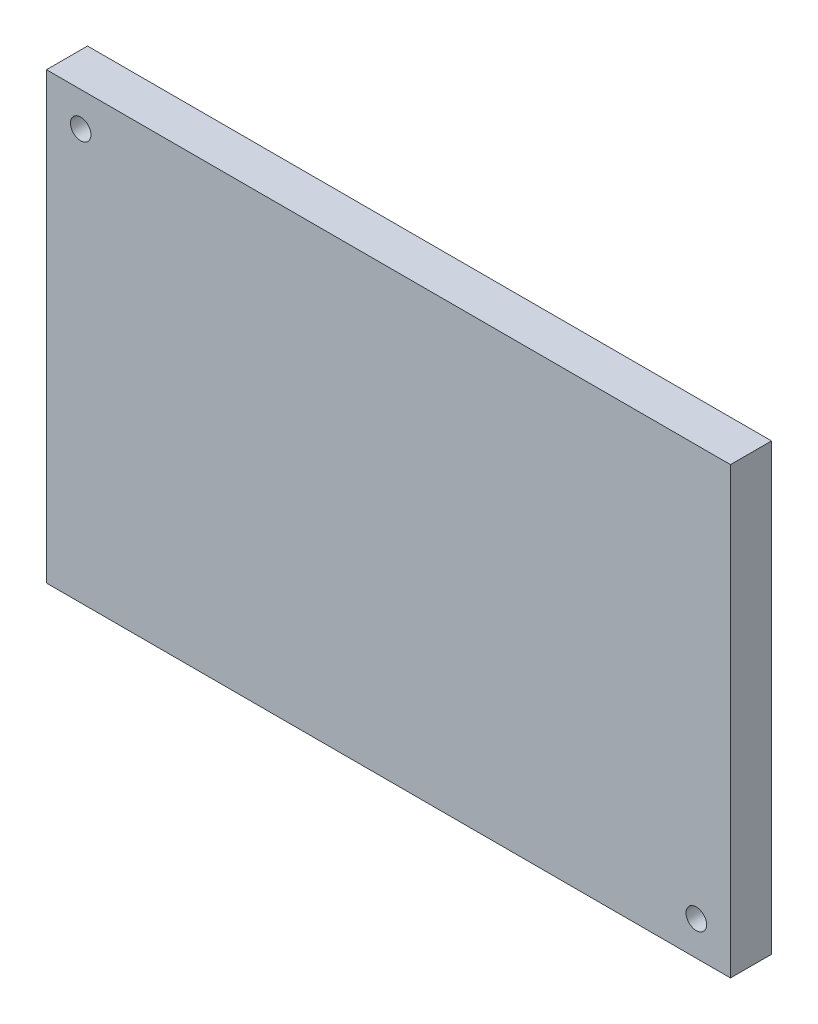
ISO-10303-21;
HEADER;
FILE_DESCRIPTION(('STEP AP214'),'2;1');
FILE_NAME('part.step','',(''),(''),'','','');
FILE_SCHEMA(('AUTOMOTIVE_DESIGN { 1 0 10303 214 1 1 1 1 }'));
ENDSEC;
DATA;
#1=APPLICATION_CONTEXT('core data for automotive mechanical design processes');
#2=APPLICATION_PROTOCOL_DEFINITION('international standard','automotive_design',2000,#1);
#3=PRODUCT_CONTEXT('',#1,'mechanical');
#4=PRODUCT('Part','Part','',(#3));
#5=PRODUCT_RELATED_PRODUCT_CATEGORY('part','',(#4));
#6=PRODUCT_DEFINITION_FORMATION('','',#4);
#7=PRODUCT_DEFINITION_CONTEXT('part definition',#1,'design');
#8=PRODUCT_DEFINITION('design','',#6,#7);
#9=PRODUCT_DEFINITION_SHAPE('','',#8);
#10=(LENGTH_UNIT() NAMED_UNIT(*) SI_UNIT(.MILLI.,.METRE.));
#11=(NAMED_UNIT(*) PLANE_ANGLE_UNIT() SI_UNIT($,.RADIAN.));
#12=(NAMED_UNIT(*) SI_UNIT($,.STERADIAN.) SOLID_ANGLE_UNIT());
#13=UNCERTAINTY_MEASURE_WITH_UNIT(LENGTH_MEASURE(1.E-05),#10,'distance_accuracy_value','');
#14=(GEOMETRIC_REPRESENTATION_CONTEXT(3) GLOBAL_UNCERTAINTY_ASSIGNED_CONTEXT((#13)) GLOBAL_UNIT_ASSIGNED_CONTEXT((#10,
#11,#12)) REPRESENTATION_CONTEXT('',''));
#15=CARTESIAN_POINT('',(0.,0.,0.));
#16=DIRECTION('',(0.,0.,1.));
#17=DIRECTION('',(1.,0.,0.));
#18=AXIS2_PLACEMENT_3D('',#15,#16,#17);
#19=CARTESIAN_POINT('',(-50.,32.5,6.));
#20=DIRECTION('',(1.,0.,0.));
#21=DIRECTION('',(0.,1.,0.));
#22=AXIS2_PLACEMENT_3D('',#19,#20,#21);
#23=PLANE('',#22);
#24=DIRECTION('',(0.,-1.,0.));
#25=VECTOR('',#24,1.);
#26=CARTESIAN_POINT('',(-50.,32.5,0.));
#27=LINE('',#26,#25);
#28=CARTESIAN_POINT('',(-50.,32.5,0.));
#29=VERTEX_POINT('',#28);
#30=CARTESIAN_POINT('',(-50.,-32.5,0.));
#31=VERTEX_POINT('',#30);
#32=EDGE_CURVE('E96',#29,#31,#27,.T.);
#33=ORIENTED_EDGE('',*,*,#32,.T.);
#34=DIRECTION('',(0.,0.,-1.));
#35=VECTOR('',#34,1.);
#36=CARTESIAN_POINT('',(-50.,-32.5,6.));
#37=LINE('',#36,#35);
#38=CARTESIAN_POINT('',(-50.,-32.5,6.));
#39=VERTEX_POINT('',#38);
#40=EDGE_CURVE('E11',#39,#31,#37,.T.);
#41=ORIENTED_EDGE('',*,*,#40,.F.);
#42=DIRECTION('',(0.,-1.,0.));
#43=VECTOR('',#42,1.);
#44=CARTESIAN_POINT('',(-50.,32.5,6.));
#45=LINE('',#44,#43);
#46=CARTESIAN_POINT('',(-50.,32.5,6.));
#47=VERTEX_POINT('',#46);
#48=EDGE_CURVE('E84',#47,#39,#45,.T.);
#49=ORIENTED_EDGE('',*,*,#48,.F.);
#50=DIRECTION('',(0.,0.,-1.));
#51=VECTOR('',#50,1.);
#52=CARTESIAN_POINT('',(-50.,32.5,6.));
#53=LINE('',#52,#51);
#54=EDGE_CURVE('E92',#47,#29,#53,.T.);
#55=ORIENTED_EDGE('',*,*,#54,.T.);
#56=EDGE_LOOP('',(#33,#41,#49,#55));
#57=FACE_BOUND('',#56,.T.);
#58=ADVANCED_FACE('F33',(#57),#23,.F.);
#59=CARTESIAN_POINT('',(-50.,-32.5,6.));
#60=DIRECTION('',(0.,1.,0.));
#61=DIRECTION('',(0.,0.,1.));
#62=AXIS2_PLACEMENT_3D('',#59,#60,#61);
#63=PLANE('',#62);
#64=DIRECTION('',(1.,0.,0.));
#65=VECTOR('',#64,1.);
#66=CARTESIAN_POINT('',(-50.,-32.5,0.));
#67=LINE('',#66,#65);
#68=CARTESIAN_POINT('',(50.,-32.5,0.));
#69=VERTEX_POINT('',#68);
#70=EDGE_CURVE('E88',#31,#69,#67,.T.);
#71=ORIENTED_EDGE('',*,*,#70,.T.);
#72=DIRECTION('',(0.,0.,-1.));
#73=VECTOR('',#72,1.);
#74=CARTESIAN_POINT('',(50.,-32.5,6.));
#75=LINE('',#74,#73);
#76=CARTESIAN_POINT('',(50.,-32.5,6.));
#77=VERTEX_POINT('',#76);
#78=EDGE_CURVE('E41',#77,#69,#75,.T.);
#79=ORIENTED_EDGE('',*,*,#78,.F.);
#80=DIRECTION('',(1.,0.,0.));
#81=VECTOR('',#80,1.);
#82=CARTESIAN_POINT('',(-50.,-32.5,6.));
#83=LINE('',#82,#81);
#84=EDGE_CURVE('E79',#39,#77,#83,.T.);
#85=ORIENTED_EDGE('',*,*,#84,.F.);
#86=ORIENTED_EDGE('',*,*,#40,.T.);
#87=EDGE_LOOP('',(#71,#79,#85,#86));
#88=FACE_BOUND('',#87,.T.);
#89=ADVANCED_FACE('F87',(#88),#63,.F.);
#90=CARTESIAN_POINT('',(50.,32.5,6.));
#91=DIRECTION('',(-1.,0.,0.));
#92=DIRECTION('',(0.,-1.,0.));
#93=AXIS2_PLACEMENT_3D('',#90,#91,#92);
#94=PLANE('',#93);
#95=DIRECTION('',(0.,1.,0.));
#96=VECTOR('',#95,1.);
#97=CARTESIAN_POINT('',(50.,32.5,0.));
#98=LINE('',#97,#96);
#99=CARTESIAN_POINT('',(50.,32.5,0.));
#100=VERTEX_POINT('',#99);
#101=EDGE_CURVE('E66',#69,#100,#98,.T.);
#102=ORIENTED_EDGE('',*,*,#101,.T.);
#103=DIRECTION('',(0.,0.,-1.));
#104=VECTOR('',#103,1.);
#105=CARTESIAN_POINT('',(50.,32.5,6.));
#106=LINE('',#105,#104);
#107=CARTESIAN_POINT('',(50.,32.5,6.));
#108=VERTEX_POINT('',#107);
#109=EDGE_CURVE('E89',#108,#100,#106,.T.);
#110=ORIENTED_EDGE('',*,*,#109,.F.);
#111=DIRECTION('',(0.,1.,0.));
#112=VECTOR('',#111,1.);
#113=CARTESIAN_POINT('',(50.,32.5,6.));
#114=LINE('',#113,#112);
#115=EDGE_CURVE('E82',#77,#108,#114,.T.);
#116=ORIENTED_EDGE('',*,*,#115,.F.);
#117=ORIENTED_EDGE('',*,*,#78,.T.);
#118=EDGE_LOOP('',(#102,#110,#116,#117));
#119=FACE_BOUND('',#118,.T.);
#120=ADVANCED_FACE('F90',(#119),#94,.F.);
#121=CARTESIAN_POINT('',(-50.,32.5,6.));
#122=DIRECTION('',(0.,-1.,0.));
#123=DIRECTION('',(0.,0.,-1.));
#124=AXIS2_PLACEMENT_3D('',#121,#122,#123);
#125=PLANE('',#124);
#126=DIRECTION('',(-1.,0.,0.));
#127=VECTOR('',#126,1.);
#128=CARTESIAN_POINT('',(-50.,32.5,0.));
#129=LINE('',#128,#127);
#130=EDGE_CURVE('E72',#100,#29,#129,.T.);
#131=ORIENTED_EDGE('',*,*,#130,.T.);
#132=ORIENTED_EDGE('',*,*,#54,.F.);
#133=DIRECTION('',(-1.,0.,0.));
#134=VECTOR('',#133,1.);
#135=CARTESIAN_POINT('',(-50.,32.5,6.));
#136=LINE('',#135,#134);
#137=EDGE_CURVE('E49',#108,#47,#136,.T.);
#138=ORIENTED_EDGE('',*,*,#137,.F.);
#139=ORIENTED_EDGE('',*,*,#109,.T.);
#140=EDGE_LOOP('',(#131,#132,#138,#139));
#141=FACE_BOUND('',#140,.T.);
#142=ADVANCED_FACE('F104',(#141),#125,.F.);
#143=CARTESIAN_POINT('',(0.,0.,6.));
#144=DIRECTION('',(0.,0.,1.));
#145=DIRECTION('',(1.,0.,0.));
#146=AXIS2_PLACEMENT_3D('',#143,#144,#145);
#147=PLANE('',#146);
#148=CARTESIAN_POINT('',(45.,-27.5,6.));
#149=DIRECTION('',(0.,0.,1.));
#150=DIRECTION('',(1.,0.,0.));
#151=AXIS2_PLACEMENT_3D('',#148,#149,#150);
#152=CIRCLE('',#151,1.5);
#153=CARTESIAN_POINT('',(46.5,-27.5,6.));
#154=VERTEX_POINT('',#153);
#155=EDGE_CURVE('E116',#154,#154,#152,.T.);
#156=ORIENTED_EDGE('',*,*,#155,.F.);
#157=EDGE_LOOP('',(#156));
#158=FACE_BOUND('',#157,.T.);
#159=CARTESIAN_POINT('',(-45.,27.5,6.));
#160=DIRECTION('',(0.,0.,1.));
#161=DIRECTION('',(1.,0.,0.));
#162=AXIS2_PLACEMENT_3D('',#159,#160,#161);
#163=CIRCLE('',#162,1.5);
#164=CARTESIAN_POINT('',(-43.5,27.5,6.));
#165=VERTEX_POINT('',#164);
#166=EDGE_CURVE('E110',#165,#165,#163,.T.);
#167=ORIENTED_EDGE('',*,*,#166,.F.);
#168=EDGE_LOOP('',(#167));
#169=FACE_BOUND('',#168,.T.);
#170=ORIENTED_EDGE('',*,*,#48,.T.);
#171=ORIENTED_EDGE('',*,*,#84,.T.);
#172=ORIENTED_EDGE('',*,*,#115,.T.);
#173=ORIENTED_EDGE('',*,*,#137,.T.);
#174=EDGE_LOOP('',(#170,#171,#172,#173));
#175=FACE_BOUND('',#174,.T.);
#176=ADVANCED_FACE('F80',(#158,#169,#175),#147,.T.);
#177=CARTESIAN_POINT('',(0.,0.,0.));
#178=DIRECTION('',(0.,0.,1.));
#179=DIRECTION('',(1.,0.,0.));
#180=AXIS2_PLACEMENT_3D('',#177,#178,#179);
#181=PLANE('',#180);
#182=CARTESIAN_POINT('',(45.,-27.5,0.));
#183=DIRECTION('',(0.,0.,1.));
#184=DIRECTION('',(1.,0.,0.));
#185=AXIS2_PLACEMENT_3D('',#182,#183,#184);
#186=CIRCLE('',#185,1.5);
#187=CARTESIAN_POINT('',(46.5,-27.5,0.));
#188=VERTEX_POINT('',#187);
#189=EDGE_CURVE('E113',#188,#188,#186,.T.);
#190=ORIENTED_EDGE('',*,*,#189,.T.);
#191=EDGE_LOOP('',(#190));
#192=FACE_BOUND('',#191,.T.);
#193=CARTESIAN_POINT('',(-45.,27.5,0.));
#194=DIRECTION('',(0.,0.,1.));
#195=DIRECTION('',(1.,0.,0.));
#196=AXIS2_PLACEMENT_3D('',#193,#194,#195);
#197=CIRCLE('',#196,1.5);
#198=CARTESIAN_POINT('',(-43.5,27.5,0.));
#199=VERTEX_POINT('',#198);
#200=EDGE_CURVE('E99',#199,#199,#197,.T.);
#201=ORIENTED_EDGE('',*,*,#200,.T.);
#202=EDGE_LOOP('',(#201));
#203=FACE_BOUND('',#202,.T.);
#204=ORIENTED_EDGE('',*,*,#32,.F.);
#205=ORIENTED_EDGE('',*,*,#130,.F.);
#206=ORIENTED_EDGE('',*,*,#101,.F.);
#207=ORIENTED_EDGE('',*,*,#70,.F.);
#208=EDGE_LOOP('',(#204,#205,#206,#207));
#209=FACE_BOUND('',#208,.T.);
#210=ADVANCED_FACE('F107',(#192,#203,#209),#181,.F.);
#211=CARTESIAN_POINT('',(-45.,27.5,0.));
#212=DIRECTION('',(0.,0.,1.));
#213=DIRECTION('',(1.,0.,0.));
#214=AXIS2_PLACEMENT_3D('',#211,#212,#213);
#215=CYLINDRICAL_SURFACE('',#214,1.5);
#216=ORIENTED_EDGE('',*,*,#200,.F.);
#217=EDGE_LOOP('',(#216));
#218=FACE_BOUND('',#217,.T.);
#219=ORIENTED_EDGE('',*,*,#166,.T.);
#220=EDGE_LOOP('',(#219));
#221=FACE_BOUND('',#220,.T.);
#222=ADVANCED_FACE('F127',(#218,#221),#215,.F.);
#223=CARTESIAN_POINT('',(45.,-27.5,0.));
#224=DIRECTION('',(0.,0.,1.));
#225=DIRECTION('',(1.,0.,0.));
#226=AXIS2_PLACEMENT_3D('',#223,#224,#225);
#227=CYLINDRICAL_SURFACE('',#226,1.5);
#228=ORIENTED_EDGE('',*,*,#189,.F.);
#229=EDGE_LOOP('',(#228));
#230=FACE_BOUND('',#229,.T.);
#231=ORIENTED_EDGE('',*,*,#155,.T.);
#232=EDGE_LOOP('',(#231));
#233=FACE_BOUND('',#232,.T.);
#234=ADVANCED_FACE('F124',(#230,#233),#227,.F.);
#235=CLOSED_SHELL('',(#58,#89,#120,#142,#176,#210,#222,#234));
#236=MANIFOLD_SOLID_BREP('B2',#235);
#237=ADVANCED_BREP_SHAPE_REPRESENTATION('',(#18,#236),#14);
#238=SHAPE_DEFINITION_REPRESENTATION(#9,#237);
ENDSEC;
END-ISO-10303-21;
